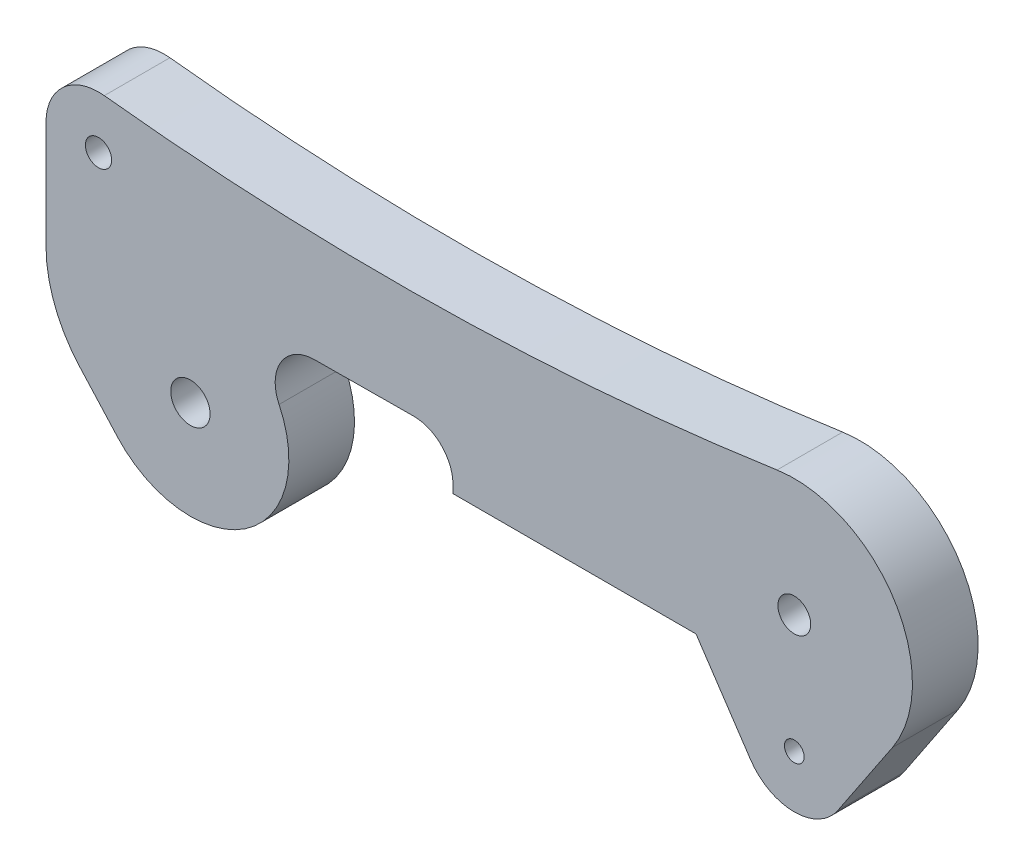
ISO-10303-21;
HEADER;
FILE_DESCRIPTION(('STEP AP214'),'2;1');
FILE_NAME('part.step','',(''),(''),'','','');
FILE_SCHEMA(('AUTOMOTIVE_DESIGN { 1 0 10303 214 1 1 1 1 }'));
ENDSEC;
DATA;
#1=APPLICATION_CONTEXT('core data for automotive mechanical design processes');
#2=APPLICATION_PROTOCOL_DEFINITION('international standard','automotive_design',2000,#1);
#3=PRODUCT_CONTEXT('',#1,'mechanical');
#4=PRODUCT('Part','Part','',(#3));
#5=PRODUCT_RELATED_PRODUCT_CATEGORY('part','',(#4));
#6=PRODUCT_DEFINITION_FORMATION('','',#4);
#7=PRODUCT_DEFINITION_CONTEXT('part definition',#1,'design');
#8=PRODUCT_DEFINITION('design','',#6,#7);
#9=PRODUCT_DEFINITION_SHAPE('','',#8);
#10=(LENGTH_UNIT() NAMED_UNIT(*) SI_UNIT(.MILLI.,.METRE.));
#11=(NAMED_UNIT(*) PLANE_ANGLE_UNIT() SI_UNIT($,.RADIAN.));
#12=(NAMED_UNIT(*) SI_UNIT($,.STERADIAN.) SOLID_ANGLE_UNIT());
#13=UNCERTAINTY_MEASURE_WITH_UNIT(LENGTH_MEASURE(1.E-05),#10,'distance_accuracy_value','');
#14=(GEOMETRIC_REPRESENTATION_CONTEXT(3) GLOBAL_UNCERTAINTY_ASSIGNED_CONTEXT((#13)) GLOBAL_UNIT_ASSIGNED_CONTEXT((#10,
#11,#12)) REPRESENTATION_CONTEXT('',''));
#15=CARTESIAN_POINT('',(0.,0.,0.));
#16=DIRECTION('',(0.,0.,1.));
#17=DIRECTION('',(1.,0.,0.));
#18=AXIS2_PLACEMENT_3D('',#15,#16,#17);
#19=CARTESIAN_POINT('',(9.45617541306992,4.56407126995754,5.));
#20=DIRECTION('',(0.,0.,-1.));
#21=DIRECTION('',(-1.,0.,0.));
#22=AXIS2_PLACEMENT_3D('',#19,#20,#21);
#23=PLANE('',#22);
#24=CARTESIAN_POINT('',(9.45617541306992,4.56407126995754,5.));
#25=DIRECTION('',(0.,0.,-1.));
#26=DIRECTION('',(-1.,0.,0.));
#27=AXIS2_PLACEMENT_3D('',#24,#25,#26);
#28=CIRCLE('',#27,3.);
#29=CARTESIAN_POINT('',(6.75441100933566,3.26005090711253,5.));
#30=VERTEX_POINT('',#29);
#31=CARTESIAN_POINT('',(9.43588173986191,7.56400263031026,5.));
#32=VERTEX_POINT('',#31);
#33=EDGE_CURVE('E209',#30,#32,#28,.T.);
#34=ORIENTED_EDGE('',*,*,#33,.T.);
#35=DIRECTION('',(0.999977120117574,0.00676455773600528,0.));
#36=VECTOR('',#35,1.);
#37=CARTESIAN_POINT('',(16.979706326792,7.61503443488054,5.));
#38=LINE('',#37,#36);
#39=CARTESIAN_POINT('',(16.979706326792,7.61503443488054,5.));
#40=VERTEX_POINT('',#39);
#41=EDGE_CURVE('E122',#32,#40,#38,.T.);
#42=ORIENTED_EDGE('',*,*,#41,.T.);
#43=CARTESIAN_POINT('',(17.,4.61510307452782,5.));
#44=DIRECTION('',(0.,0.,-1.));
#45=DIRECTION('',(1.,0.,0.));
#46=AXIS2_PLACEMENT_3D('',#43,#44,#45);
#47=CIRCLE('',#46,3.);
#48=CARTESIAN_POINT('',(20.,4.61510307452782,5.));
#49=VERTEX_POINT('',#48);
#50=EDGE_CURVE('E245',#40,#49,#47,.T.);
#51=ORIENTED_EDGE('',*,*,#50,.T.);
#52=DIRECTION('',(0.,-1.,0.));
#53=VECTOR('',#52,1.);
#54=CARTESIAN_POINT('',(20.,4.,5.));
#55=LINE('',#54,#53);
#56=CARTESIAN_POINT('',(20.,4.,5.));
#57=VERTEX_POINT('',#56);
#58=EDGE_CURVE('E264',#49,#57,#55,.T.);
#59=ORIENTED_EDGE('',*,*,#58,.T.);
#60=DIRECTION('',(1.,0.,0.));
#61=VECTOR('',#60,1.);
#62=CARTESIAN_POINT('',(38.5166852264521,4.,5.));
#63=LINE('',#62,#61);
#64=CARTESIAN_POINT('',(38.5166852264521,4.,5.));
#65=VERTEX_POINT('',#64);
#66=EDGE_CURVE('E261',#57,#65,#63,.T.);
#67=ORIENTED_EDGE('',*,*,#66,.T.);
#68=DIRECTION('',(0.555555555555556,-0.831479419283098,0.));
#69=VECTOR('',#68,1.);
#70=CARTESIAN_POINT('',(42.6740823228676,-2.22222222222222,5.));
#71=LINE('',#70,#69);
#72=CARTESIAN_POINT('',(42.6740823228676,-2.22222222222222,5.));
#73=VERTEX_POINT('',#72);
#74=EDGE_CURVE('E263',#65,#73,#71,.T.);
#75=ORIENTED_EDGE('',*,*,#74,.T.);
#76=CARTESIAN_POINT('',(46.,0.,5.));
#77=DIRECTION('',(0.,0.,1.));
#78=DIRECTION('',(1.,0.,0.));
#79=AXIS2_PLACEMENT_3D('',#76,#77,#78);
#80=CIRCLE('',#79,4.);
#81=CARTESIAN_POINT('',(49.3259176771324,-2.22222222222219,5.));
#82=VERTEX_POINT('',#81);
#83=EDGE_CURVE('E266',#73,#82,#80,.T.);
#84=ORIENTED_EDGE('',*,*,#83,.T.);
#85=DIRECTION('',(0.555555555555556,0.831479419283098,0.));
#86=VECTOR('',#85,1.);
#87=CARTESIAN_POINT('',(53.4833147735479,4.,5.));
#88=LINE('',#87,#86);
#89=CARTESIAN_POINT('',(53.4833147735478,4.00000000000002,5.));
#90=VERTEX_POINT('',#89);
#91=EDGE_CURVE('E272',#82,#90,#88,.T.);
#92=ORIENTED_EDGE('',*,*,#91,.T.);
#93=CARTESIAN_POINT('',(46.,9.,5.));
#94=DIRECTION('',(0.,0.,1.));
#95=DIRECTION('',(1.,0.,0.));
#96=AXIS2_PLACEMENT_3D('',#93,#94,#95);
#97=CIRCLE('',#96,8.99999999999996);
#98=CARTESIAN_POINT('',(44.6854116319225,17.9034744579021,5.));
#99=VERTEX_POINT('',#98);
#100=EDGE_CURVE('E274',#90,#99,#97,.T.);
#101=ORIENTED_EDGE('',*,*,#100,.T.);
#102=CARTESIAN_POINT('',(15.4723367857572,215.758462411283,5.));
#103=DIRECTION('',(0.,0.,-1.));
#104=DIRECTION('',(1.,0.,0.));
#105=AXIS2_PLACEMENT_3D('',#102,#103,#104);
#106=CIRCLE('',#105,200.);
#107=CARTESIAN_POINT('',(-6.55936594537731,16.9756561257114,5.));
#108=VERTEX_POINT('',#107);
#109=EDGE_CURVE('E276',#99,#108,#106,.T.);
#110=ORIENTED_EDGE('',*,*,#109,.T.);
#111=CARTESIAN_POINT('',(-7.,13.,5.));
#112=DIRECTION('',(0.,0.,1.));
#113=DIRECTION('',(1.,0.,0.));
#114=AXIS2_PLACEMENT_3D('',#111,#112,#113);
#115=CIRCLE('',#114,3.99999999999998);
#116=CARTESIAN_POINT('',(-11.,13.,5.));
#117=VERTEX_POINT('',#116);
#118=EDGE_CURVE('E278',#108,#117,#115,.T.);
#119=ORIENTED_EDGE('',*,*,#118,.T.);
#120=DIRECTION('',(0.,-1.,0.));
#121=VECTOR('',#120,1.);
#122=CARTESIAN_POINT('',(-11.,13.,5.));
#123=LINE('',#122,#121);
#124=CARTESIAN_POINT('',(-11.,4.8425066865478,5.));
#125=VERTEX_POINT('',#124);
#126=EDGE_CURVE('E162',#117,#125,#123,.T.);
#127=ORIENTED_EDGE('',*,*,#126,.T.);
#128=CARTESIAN_POINT('',(-1.,4.8425066865478,5.));
#129=DIRECTION('',(0.,0.,1.));
#130=DIRECTION('',(-1.,0.,0.));
#131=AXIS2_PLACEMENT_3D('',#128,#129,#130);
#132=CIRCLE('',#131,10.);
#133=CARTESIAN_POINT('',(-8.42693748935353,-1.85380569634139,5.));
#134=VERTEX_POINT('',#133);
#135=EDGE_CURVE('E156',#125,#134,#132,.T.);
#136=ORIENTED_EDGE('',*,*,#135,.T.);
#137=DIRECTION('',(0.669631238288916,-0.742693748935356,0.));
#138=VECTOR('',#137,1.);
#139=CARTESIAN_POINT('',(-8.42693748935353,-1.85380569634139,5.));
#140=LINE('',#139,#138);
#141=CARTESIAN_POINT('',(-5.57020311701517,-5.02223428716687,5.));
#142=VERTEX_POINT('',#141);
#143=EDGE_CURVE('E160',#134,#142,#140,.T.);
#144=ORIENTED_EDGE('',*,*,#143,.T.);
#145=CARTESIAN_POINT('',(0.,0.,5.));
#146=DIRECTION('',(0.,0.,1.));
#147=DIRECTION('',(1.,0.,0.));
#148=AXIS2_PLACEMENT_3D('',#145,#146,#147);
#149=CIRCLE('',#148,7.5);
#150=EDGE_CURVE('E58',#142,#30,#149,.T.);
#151=ORIENTED_EDGE('',*,*,#150,.T.);
#152=EDGE_LOOP('',(#34,#42,#51,#59,#67,#75,#84,#92,#101,#110,#119,#127,#136,#144,#151));
#153=FACE_BOUND('',#152,.T.);
#154=CARTESIAN_POINT('',(0.,0.,5.));
#155=DIRECTION('',(0.,0.,1.));
#156=DIRECTION('',(1.,0.,0.));
#157=AXIS2_PLACEMENT_3D('',#154,#155,#156);
#158=CIRCLE('',#157,1.5);
#159=CARTESIAN_POINT('',(1.5,0.,5.));
#160=VERTEX_POINT('',#159);
#161=EDGE_CURVE('E184',#160,#160,#158,.T.);
#162=ORIENTED_EDGE('',*,*,#161,.F.);
#163=EDGE_LOOP('',(#162));
#164=FACE_BOUND('',#163,.T.);
#165=CARTESIAN_POINT('',(46.,0.,5.));
#166=DIRECTION('',(0.,0.,1.));
#167=DIRECTION('',(1.,0.,0.));
#168=AXIS2_PLACEMENT_3D('',#165,#166,#167);
#169=CIRCLE('',#168,0.749999999999999);
#170=CARTESIAN_POINT('',(46.75,0.,5.));
#171=VERTEX_POINT('',#170);
#172=EDGE_CURVE('E342',#171,#171,#169,.T.);
#173=ORIENTED_EDGE('',*,*,#172,.F.);
#174=EDGE_LOOP('',(#173));
#175=FACE_BOUND('',#174,.T.);
#176=CARTESIAN_POINT('',(46.,9.,5.));
#177=DIRECTION('',(0.,0.,1.));
#178=DIRECTION('',(1.,0.,0.));
#179=AXIS2_PLACEMENT_3D('',#176,#177,#178);
#180=CIRCLE('',#179,1.25);
#181=CARTESIAN_POINT('',(47.25,9.,5.));
#182=VERTEX_POINT('',#181);
#183=EDGE_CURVE('E336',#182,#182,#180,.T.);
#184=ORIENTED_EDGE('',*,*,#183,.F.);
#185=EDGE_LOOP('',(#184));
#186=FACE_BOUND('',#185,.T.);
#187=CARTESIAN_POINT('',(-7.,13.,5.));
#188=DIRECTION('',(0.,0.,1.));
#189=DIRECTION('',(1.,0.,0.));
#190=AXIS2_PLACEMENT_3D('',#187,#188,#189);
#191=CIRCLE('',#190,1.);
#192=CARTESIAN_POINT('',(-6.,13.,5.));
#193=VERTEX_POINT('',#192);
#194=EDGE_CURVE('E327',#193,#193,#191,.T.);
#195=ORIENTED_EDGE('',*,*,#194,.F.);
#196=EDGE_LOOP('',(#195));
#197=FACE_BOUND('',#196,.T.);
#198=ADVANCED_FACE('F41',(#153,#164,#175,#186,#197),#23,.F.);
#199=CARTESIAN_POINT('',(9.45617541306992,4.56407126995754,0.));
#200=DIRECTION('',(0.,0.,-1.));
#201=DIRECTION('',(-1.,0.,0.));
#202=AXIS2_PLACEMENT_3D('',#199,#200,#201);
#203=PLANE('',#202);
#204=CARTESIAN_POINT('',(46.,9.,0.));
#205=DIRECTION('',(0.,0.,1.));
#206=DIRECTION('',(1.,0.,0.));
#207=AXIS2_PLACEMENT_3D('',#204,#205,#206);
#208=CIRCLE('',#207,1.25);
#209=CARTESIAN_POINT('',(47.25,9.,0.));
#210=VERTEX_POINT('',#209);
#211=EDGE_CURVE('E333',#210,#210,#208,.T.);
#212=ORIENTED_EDGE('',*,*,#211,.T.);
#213=EDGE_LOOP('',(#212));
#214=FACE_BOUND('',#213,.T.);
#215=CARTESIAN_POINT('',(0.,0.,0.));
#216=DIRECTION('',(0.,0.,1.));
#217=DIRECTION('',(1.,0.,0.));
#218=AXIS2_PLACEMENT_3D('',#215,#216,#217);
#219=CIRCLE('',#218,1.5);
#220=CARTESIAN_POINT('',(1.5,0.,0.));
#221=VERTEX_POINT('',#220);
#222=EDGE_CURVE('E345',#221,#221,#219,.T.);
#223=ORIENTED_EDGE('',*,*,#222,.T.);
#224=EDGE_LOOP('',(#223));
#225=FACE_BOUND('',#224,.T.);
#226=CARTESIAN_POINT('',(9.45617541306992,4.56407126995754,0.));
#227=DIRECTION('',(0.,0.,-1.));
#228=DIRECTION('',(-1.,0.,0.));
#229=AXIS2_PLACEMENT_3D('',#226,#227,#228);
#230=CIRCLE('',#229,3.);
#231=CARTESIAN_POINT('',(6.75441100933566,3.26005090711253,0.));
#232=VERTEX_POINT('',#231);
#233=CARTESIAN_POINT('',(9.43588173986191,7.56400263031026,0.));
#234=VERTEX_POINT('',#233);
#235=EDGE_CURVE('E180',#232,#234,#230,.T.);
#236=ORIENTED_EDGE('',*,*,#235,.F.);
#237=CARTESIAN_POINT('',(0.,0.,0.));
#238=DIRECTION('',(0.,0.,1.));
#239=DIRECTION('',(1.,0.,0.));
#240=AXIS2_PLACEMENT_3D('',#237,#238,#239);
#241=CIRCLE('',#240,7.5);
#242=CARTESIAN_POINT('',(-5.57020311701517,-5.02223428716687,0.));
#243=VERTEX_POINT('',#242);
#244=EDGE_CURVE('E114',#243,#232,#241,.T.);
#245=ORIENTED_EDGE('',*,*,#244,.F.);
#246=DIRECTION('',(0.669631238288916,-0.742693748935356,0.));
#247=VECTOR('',#246,1.);
#248=CARTESIAN_POINT('',(-8.42693748935353,-1.85380569634139,0.));
#249=LINE('',#248,#247);
#250=CARTESIAN_POINT('',(-8.42693748935353,-1.85380569634139,0.));
#251=VERTEX_POINT('',#250);
#252=EDGE_CURVE('E108',#251,#243,#249,.T.);
#253=ORIENTED_EDGE('',*,*,#252,.F.);
#254=CARTESIAN_POINT('',(-1.,4.8425066865478,0.));
#255=DIRECTION('',(0.,0.,1.));
#256=DIRECTION('',(-1.,0.,0.));
#257=AXIS2_PLACEMENT_3D('',#254,#255,#256);
#258=CIRCLE('',#257,10.);
#259=CARTESIAN_POINT('',(-11.,4.8425066865478,0.));
#260=VERTEX_POINT('',#259);
#261=EDGE_CURVE('E170',#260,#251,#258,.T.);
#262=ORIENTED_EDGE('',*,*,#261,.F.);
#263=DIRECTION('',(0.,-1.,0.));
#264=VECTOR('',#263,1.);
#265=CARTESIAN_POINT('',(-11.,13.,0.));
#266=LINE('',#265,#264);
#267=CARTESIAN_POINT('',(-11.,13.,0.));
#268=VERTEX_POINT('',#267);
#269=EDGE_CURVE('E204',#268,#260,#266,.T.);
#270=ORIENTED_EDGE('',*,*,#269,.F.);
#271=CARTESIAN_POINT('',(-7.,13.,0.));
#272=DIRECTION('',(0.,0.,1.));
#273=DIRECTION('',(1.,0.,0.));
#274=AXIS2_PLACEMENT_3D('',#271,#272,#273);
#275=CIRCLE('',#274,3.99999999999998);
#276=CARTESIAN_POINT('',(-6.55936594537731,16.9756561257114,0.));
#277=VERTEX_POINT('',#276);
#278=EDGE_CURVE('E202',#277,#268,#275,.T.);
#279=ORIENTED_EDGE('',*,*,#278,.F.);
#280=CARTESIAN_POINT('',(15.4723367857572,215.758462411283,0.));
#281=DIRECTION('',(0.,0.,-1.));
#282=DIRECTION('',(1.,0.,0.));
#283=AXIS2_PLACEMENT_3D('',#280,#281,#282);
#284=CIRCLE('',#283,200.);
#285=CARTESIAN_POINT('',(44.6854116319225,17.9034744579021,0.));
#286=VERTEX_POINT('',#285);
#287=EDGE_CURVE('E200',#286,#277,#284,.T.);
#288=ORIENTED_EDGE('',*,*,#287,.F.);
#289=CARTESIAN_POINT('',(46.,9.,0.));
#290=DIRECTION('',(0.,0.,1.));
#291=DIRECTION('',(1.,0.,0.));
#292=AXIS2_PLACEMENT_3D('',#289,#290,#291);
#293=CIRCLE('',#292,8.99999999999996);
#294=CARTESIAN_POINT('',(53.4833147735478,4.00000000000002,0.));
#295=VERTEX_POINT('',#294);
#296=EDGE_CURVE('E198',#295,#286,#293,.T.);
#297=ORIENTED_EDGE('',*,*,#296,.F.);
#298=DIRECTION('',(0.555555555555556,0.831479419283098,0.));
#299=VECTOR('',#298,1.);
#300=CARTESIAN_POINT('',(53.4833147735479,4.,0.));
#301=LINE('',#300,#299);
#302=CARTESIAN_POINT('',(49.3259176771324,-2.22222222222219,0.));
#303=VERTEX_POINT('',#302);
#304=EDGE_CURVE('E196',#303,#295,#301,.T.);
#305=ORIENTED_EDGE('',*,*,#304,.F.);
#306=CARTESIAN_POINT('',(46.,0.,0.));
#307=DIRECTION('',(0.,0.,1.));
#308=DIRECTION('',(1.,0.,0.));
#309=AXIS2_PLACEMENT_3D('',#306,#307,#308);
#310=CIRCLE('',#309,4.);
#311=CARTESIAN_POINT('',(42.6740823228676,-2.22222222222222,0.));
#312=VERTEX_POINT('',#311);
#313=EDGE_CURVE('E194',#312,#303,#310,.T.);
#314=ORIENTED_EDGE('',*,*,#313,.F.);
#315=DIRECTION('',(0.555555555555556,-0.831479419283098,0.));
#316=VECTOR('',#315,1.);
#317=CARTESIAN_POINT('',(42.6740823228676,-2.22222222222222,0.));
#318=LINE('',#317,#316);
#319=CARTESIAN_POINT('',(38.5166852264521,4.,0.));
#320=VERTEX_POINT('',#319);
#321=EDGE_CURVE('E192',#320,#312,#318,.T.);
#322=ORIENTED_EDGE('',*,*,#321,.F.);
#323=DIRECTION('',(1.,0.,0.));
#324=VECTOR('',#323,1.);
#325=CARTESIAN_POINT('',(38.5166852264521,4.,0.));
#326=LINE('',#325,#324);
#327=CARTESIAN_POINT('',(20.,4.,0.));
#328=VERTEX_POINT('',#327);
#329=EDGE_CURVE('E190',#328,#320,#326,.T.);
#330=ORIENTED_EDGE('',*,*,#329,.F.);
#331=DIRECTION('',(0.,-1.,0.));
#332=VECTOR('',#331,1.);
#333=CARTESIAN_POINT('',(20.,4.,0.));
#334=LINE('',#333,#332);
#335=CARTESIAN_POINT('',(20.,4.61510307452782,0.));
#336=VERTEX_POINT('',#335);
#337=EDGE_CURVE('E188',#336,#328,#334,.T.);
#338=ORIENTED_EDGE('',*,*,#337,.F.);
#339=CARTESIAN_POINT('',(17.,4.61510307452782,0.));
#340=DIRECTION('',(0.,0.,-1.));
#341=DIRECTION('',(1.,0.,0.));
#342=AXIS2_PLACEMENT_3D('',#339,#340,#341);
#343=CIRCLE('',#342,3.);
#344=CARTESIAN_POINT('',(16.979706326792,7.61503443488054,0.));
#345=VERTEX_POINT('',#344);
#346=EDGE_CURVE('E186',#345,#336,#343,.T.);
#347=ORIENTED_EDGE('',*,*,#346,.F.);
#348=DIRECTION('',(0.999977120117574,0.00676455773600528,0.));
#349=VECTOR('',#348,1.);
#350=CARTESIAN_POINT('',(16.979706326792,7.61503443488054,0.));
#351=LINE('',#350,#349);
#352=EDGE_CURVE('E183',#234,#345,#351,.T.);
#353=ORIENTED_EDGE('',*,*,#352,.F.);
#354=EDGE_LOOP('',(#236,#245,#253,#262,#270,#279,#288,#297,#305,#314,#322,#330,#338,#347,#353));
#355=FACE_BOUND('',#354,.T.);
#356=CARTESIAN_POINT('',(46.,0.,0.));
#357=DIRECTION('',(0.,0.,1.));
#358=DIRECTION('',(1.,0.,0.));
#359=AXIS2_PLACEMENT_3D('',#356,#357,#358);
#360=CIRCLE('',#359,0.749999999999999);
#361=CARTESIAN_POINT('',(46.75,0.,0.));
#362=VERTEX_POINT('',#361);
#363=EDGE_CURVE('E339',#362,#362,#360,.T.);
#364=ORIENTED_EDGE('',*,*,#363,.T.);
#365=EDGE_LOOP('',(#364));
#366=FACE_BOUND('',#365,.T.);
#367=CARTESIAN_POINT('',(-7.,13.,0.));
#368=DIRECTION('',(0.,0.,1.));
#369=DIRECTION('',(1.,0.,0.));
#370=AXIS2_PLACEMENT_3D('',#367,#368,#369);
#371=CIRCLE('',#370,1.);
#372=CARTESIAN_POINT('',(-6.,13.,0.));
#373=VERTEX_POINT('',#372);
#374=EDGE_CURVE('E330',#373,#373,#371,.T.);
#375=ORIENTED_EDGE('',*,*,#374,.T.);
#376=EDGE_LOOP('',(#375));
#377=FACE_BOUND('',#376,.T.);
#378=ADVANCED_FACE('F249',(#214,#225,#355,#366,#377),#203,.T.);
#379=CARTESIAN_POINT('',(9.45617541306992,4.56407126995754,5.));
#380=DIRECTION('',(0.,0.,-1.));
#381=DIRECTION('',(-1.,0.,0.));
#382=AXIS2_PLACEMENT_3D('',#379,#380,#381);
#383=CYLINDRICAL_SURFACE('',#382,3.);
#384=ORIENTED_EDGE('',*,*,#235,.T.);
#385=DIRECTION('',(0.,0.,-1.));
#386=VECTOR('',#385,1.);
#387=CARTESIAN_POINT('',(9.43588173986191,7.56400263031026,5.));
#388=LINE('',#387,#386);
#389=EDGE_CURVE('E11',#32,#234,#388,.T.);
#390=ORIENTED_EDGE('',*,*,#389,.F.);
#391=ORIENTED_EDGE('',*,*,#33,.F.);
#392=DIRECTION('',(0.,0.,-1.));
#393=VECTOR('',#392,1.);
#394=CARTESIAN_POINT('',(6.75441100933566,3.26005090711253,5.));
#395=LINE('',#394,#393);
#396=EDGE_CURVE('E176',#30,#232,#395,.T.);
#397=ORIENTED_EDGE('',*,*,#396,.T.);
#398=EDGE_LOOP('',(#384,#390,#391,#397));
#399=FACE_BOUND('',#398,.T.);
#400=ADVANCED_FACE('F43',(#399),#383,.F.);
#401=CARTESIAN_POINT('',(16.979706326792,7.61503443488054,5.));
#402=DIRECTION('',(-0.00676455773600528,0.999977120117574,0.));
#403=DIRECTION('',(-0.999977120117574,-0.00676455773600528,0.));
#404=AXIS2_PLACEMENT_3D('',#401,#402,#403);
#405=PLANE('',#404);
#406=ORIENTED_EDGE('',*,*,#352,.T.);
#407=DIRECTION('',(0.,0.,-1.));
#408=VECTOR('',#407,1.);
#409=CARTESIAN_POINT('',(16.979706326792,7.61503443488054,5.));
#410=LINE('',#409,#408);
#411=EDGE_CURVE('E50',#40,#345,#410,.T.);
#412=ORIENTED_EDGE('',*,*,#411,.F.);
#413=ORIENTED_EDGE('',*,*,#41,.F.);
#414=ORIENTED_EDGE('',*,*,#389,.T.);
#415=EDGE_LOOP('',(#406,#412,#413,#414));
#416=FACE_BOUND('',#415,.T.);
#417=ADVANCED_FACE('F433',(#416),#405,.F.);
#418=CARTESIAN_POINT('',(17.,4.61510307452782,5.));
#419=DIRECTION('',(0.,0.,-1.));
#420=DIRECTION('',(-1.,0.,0.));
#421=AXIS2_PLACEMENT_3D('',#418,#419,#420);
#422=CYLINDRICAL_SURFACE('',#421,3.);
#423=ORIENTED_EDGE('',*,*,#346,.T.);
#424=DIRECTION('',(0.,0.,-1.));
#425=VECTOR('',#424,1.);
#426=CARTESIAN_POINT('',(20.,4.61510307452782,5.));
#427=LINE('',#426,#425);
#428=EDGE_CURVE('E237',#49,#336,#427,.T.);
#429=ORIENTED_EDGE('',*,*,#428,.F.);
#430=ORIENTED_EDGE('',*,*,#50,.F.);
#431=ORIENTED_EDGE('',*,*,#411,.T.);
#432=EDGE_LOOP('',(#423,#429,#430,#431));
#433=FACE_BOUND('',#432,.T.);
#434=ADVANCED_FACE('F243',(#433),#422,.F.);
#435=CARTESIAN_POINT('',(20.,4.,5.));
#436=DIRECTION('',(1.,0.,0.));
#437=DIRECTION('',(0.,0.,-1.));
#438=AXIS2_PLACEMENT_3D('',#435,#436,#437);
#439=PLANE('',#438);
#440=ORIENTED_EDGE('',*,*,#337,.T.);
#441=DIRECTION('',(0.,0.,-1.));
#442=VECTOR('',#441,1.);
#443=CARTESIAN_POINT('',(20.,4.,5.));
#444=LINE('',#443,#442);
#445=EDGE_CURVE('E234',#57,#328,#444,.T.);
#446=ORIENTED_EDGE('',*,*,#445,.F.);
#447=ORIENTED_EDGE('',*,*,#58,.F.);
#448=ORIENTED_EDGE('',*,*,#428,.T.);
#449=EDGE_LOOP('',(#440,#446,#447,#448));
#450=FACE_BOUND('',#449,.T.);
#451=ADVANCED_FACE('F255',(#450),#439,.F.);
#452=CARTESIAN_POINT('',(38.5166852264521,4.,5.));
#453=DIRECTION('',(0.,1.,0.));
#454=DIRECTION('',(-1.,0.,0.));
#455=AXIS2_PLACEMENT_3D('',#452,#453,#454);
#456=PLANE('',#455);
#457=ORIENTED_EDGE('',*,*,#329,.T.);
#458=DIRECTION('',(0.,0.,-1.));
#459=VECTOR('',#458,1.);
#460=CARTESIAN_POINT('',(38.5166852264521,4.,5.));
#461=LINE('',#460,#459);
#462=EDGE_CURVE('E231',#65,#320,#461,.T.);
#463=ORIENTED_EDGE('',*,*,#462,.F.);
#464=ORIENTED_EDGE('',*,*,#66,.F.);
#465=ORIENTED_EDGE('',*,*,#445,.T.);
#466=EDGE_LOOP('',(#457,#463,#464,#465));
#467=FACE_BOUND('',#466,.T.);
#468=ADVANCED_FACE('F259',(#467),#456,.F.);
#469=CARTESIAN_POINT('',(42.6740823228676,-2.22222222222222,5.));
#470=DIRECTION('',(0.831479419283098,0.555555555555556,0.));
#471=DIRECTION('',(-0.555555555555556,0.831479419283098,0.));
#472=AXIS2_PLACEMENT_3D('',#469,#470,#471);
#473=PLANE('',#472);
#474=ORIENTED_EDGE('',*,*,#321,.T.);
#475=DIRECTION('',(0.,0.,-1.));
#476=VECTOR('',#475,1.);
#477=CARTESIAN_POINT('',(42.6740823228676,-2.22222222222222,5.));
#478=LINE('',#477,#476);
#479=EDGE_CURVE('E228',#73,#312,#478,.T.);
#480=ORIENTED_EDGE('',*,*,#479,.F.);
#481=ORIENTED_EDGE('',*,*,#74,.F.);
#482=ORIENTED_EDGE('',*,*,#462,.T.);
#483=EDGE_LOOP('',(#474,#480,#481,#482));
#484=FACE_BOUND('',#483,.T.);
#485=ADVANCED_FACE('F464',(#484),#473,.F.);
#486=CARTESIAN_POINT('',(46.,0.,5.));
#487=DIRECTION('',(0.,0.,-1.));
#488=DIRECTION('',(-1.,0.,0.));
#489=AXIS2_PLACEMENT_3D('',#486,#487,#488);
#490=CYLINDRICAL_SURFACE('',#489,4.);
#491=ORIENTED_EDGE('',*,*,#313,.T.);
#492=DIRECTION('',(0.,0.,-1.));
#493=VECTOR('',#492,1.);
#494=CARTESIAN_POINT('',(49.3259176771324,-2.22222222222219,5.));
#495=LINE('',#494,#493);
#496=EDGE_CURVE('E225',#82,#303,#495,.T.);
#497=ORIENTED_EDGE('',*,*,#496,.F.);
#498=ORIENTED_EDGE('',*,*,#83,.F.);
#499=ORIENTED_EDGE('',*,*,#479,.T.);
#500=EDGE_LOOP('',(#491,#497,#498,#499));
#501=FACE_BOUND('',#500,.T.);
#502=ADVANCED_FACE('F473',(#501),#490,.T.);
#503=CARTESIAN_POINT('',(53.4833147735479,4.,5.));
#504=DIRECTION('',(-0.831479419283098,0.555555555555556,0.));
#505=DIRECTION('',(-0.555555555555556,-0.831479419283098,0.));
#506=AXIS2_PLACEMENT_3D('',#503,#504,#505);
#507=PLANE('',#506);
#508=ORIENTED_EDGE('',*,*,#304,.T.);
#509=DIRECTION('',(0.,0.,-1.));
#510=VECTOR('',#509,1.);
#511=CARTESIAN_POINT('',(53.4833147735478,4.00000000000002,5.));
#512=LINE('',#511,#510);
#513=EDGE_CURVE('E222',#90,#295,#512,.T.);
#514=ORIENTED_EDGE('',*,*,#513,.F.);
#515=ORIENTED_EDGE('',*,*,#91,.F.);
#516=ORIENTED_EDGE('',*,*,#496,.T.);
#517=EDGE_LOOP('',(#508,#514,#515,#516));
#518=FACE_BOUND('',#517,.T.);
#519=ADVANCED_FACE('F483',(#518),#507,.F.);
#520=CARTESIAN_POINT('',(46.,9.,5.));
#521=DIRECTION('',(0.,0.,-1.));
#522=DIRECTION('',(-1.,0.,0.));
#523=AXIS2_PLACEMENT_3D('',#520,#521,#522);
#524=CYLINDRICAL_SURFACE('',#523,8.99999999999996);
#525=ORIENTED_EDGE('',*,*,#296,.T.);
#526=DIRECTION('',(0.,0.,-1.));
#527=VECTOR('',#526,1.);
#528=CARTESIAN_POINT('',(44.6854116319225,17.9034744579021,5.));
#529=LINE('',#528,#527);
#530=EDGE_CURVE('E219',#99,#286,#529,.T.);
#531=ORIENTED_EDGE('',*,*,#530,.F.);
#532=ORIENTED_EDGE('',*,*,#100,.F.);
#533=ORIENTED_EDGE('',*,*,#513,.T.);
#534=EDGE_LOOP('',(#525,#531,#532,#533));
#535=FACE_BOUND('',#534,.T.);
#536=ADVANCED_FACE('F493',(#535),#524,.T.);
#537=CARTESIAN_POINT('',(15.4723367857572,215.758462411283,5.));
#538=DIRECTION('',(0.,0.,-1.));
#539=DIRECTION('',(-1.,0.,0.));
#540=AXIS2_PLACEMENT_3D('',#537,#538,#539);
#541=CYLINDRICAL_SURFACE('',#540,200.);
#542=ORIENTED_EDGE('',*,*,#287,.T.);
#543=DIRECTION('',(0.,0.,-1.));
#544=VECTOR('',#543,1.);
#545=CARTESIAN_POINT('',(-6.55936594537731,16.9756561257114,5.));
#546=LINE('',#545,#544);
#547=EDGE_CURVE('E216',#108,#277,#546,.T.);
#548=ORIENTED_EDGE('',*,*,#547,.F.);
#549=ORIENTED_EDGE('',*,*,#109,.F.);
#550=ORIENTED_EDGE('',*,*,#530,.T.);
#551=EDGE_LOOP('',(#542,#548,#549,#550));
#552=FACE_BOUND('',#551,.T.);
#553=ADVANCED_FACE('F503',(#552),#541,.F.);
#554=CARTESIAN_POINT('',(-7.,13.,5.));
#555=DIRECTION('',(0.,0.,-1.));
#556=DIRECTION('',(-1.,0.,0.));
#557=AXIS2_PLACEMENT_3D('',#554,#555,#556);
#558=CYLINDRICAL_SURFACE('',#557,3.99999999999998);
#559=ORIENTED_EDGE('',*,*,#278,.T.);
#560=DIRECTION('',(0.,0.,-1.));
#561=VECTOR('',#560,1.);
#562=CARTESIAN_POINT('',(-11.,13.,5.));
#563=LINE('',#562,#561);
#564=EDGE_CURVE('E213',#117,#268,#563,.T.);
#565=ORIENTED_EDGE('',*,*,#564,.F.);
#566=ORIENTED_EDGE('',*,*,#118,.F.);
#567=ORIENTED_EDGE('',*,*,#547,.T.);
#568=EDGE_LOOP('',(#559,#565,#566,#567));
#569=FACE_BOUND('',#568,.T.);
#570=ADVANCED_FACE('F284',(#569),#558,.T.);
#571=CARTESIAN_POINT('',(-11.,13.,5.));
#572=DIRECTION('',(1.,0.,0.));
#573=DIRECTION('',(0.,1.,0.));
#574=AXIS2_PLACEMENT_3D('',#571,#572,#573);
#575=PLANE('',#574);
#576=ORIENTED_EDGE('',*,*,#269,.T.);
#577=DIRECTION('',(0.,0.,-1.));
#578=VECTOR('',#577,1.);
#579=CARTESIAN_POINT('',(-11.,4.8425066865478,5.));
#580=LINE('',#579,#578);
#581=EDGE_CURVE('E171',#125,#260,#580,.T.);
#582=ORIENTED_EDGE('',*,*,#581,.F.);
#583=ORIENTED_EDGE('',*,*,#126,.F.);
#584=ORIENTED_EDGE('',*,*,#564,.T.);
#585=EDGE_LOOP('',(#576,#582,#583,#584));
#586=FACE_BOUND('',#585,.T.);
#587=ADVANCED_FACE('F288',(#586),#575,.F.);
#588=CARTESIAN_POINT('',(-1.,4.8425066865478,5.));
#589=DIRECTION('',(0.,0.,-1.));
#590=DIRECTION('',(-1.,0.,0.));
#591=AXIS2_PLACEMENT_3D('',#588,#589,#590);
#592=CYLINDRICAL_SURFACE('',#591,10.);
#593=ORIENTED_EDGE('',*,*,#261,.T.);
#594=DIRECTION('',(0.,0.,-1.));
#595=VECTOR('',#594,1.);
#596=CARTESIAN_POINT('',(-8.42693748935353,-1.85380569634139,5.));
#597=LINE('',#596,#595);
#598=EDGE_CURVE('E167',#134,#251,#597,.T.);
#599=ORIENTED_EDGE('',*,*,#598,.F.);
#600=ORIENTED_EDGE('',*,*,#135,.F.);
#601=ORIENTED_EDGE('',*,*,#581,.T.);
#602=EDGE_LOOP('',(#593,#599,#600,#601));
#603=FACE_BOUND('',#602,.T.);
#604=ADVANCED_FACE('F168',(#603),#592,.T.);
#605=CARTESIAN_POINT('',(-8.42693748935353,-1.85380569634139,5.));
#606=DIRECTION('',(0.742693748935356,0.669631238288916,0.));
#607=DIRECTION('',(-0.669631238288916,0.742693748935356,0.));
#608=AXIS2_PLACEMENT_3D('',#605,#606,#607);
#609=PLANE('',#608);
#610=ORIENTED_EDGE('',*,*,#252,.T.);
#611=DIRECTION('',(0.,0.,-1.));
#612=VECTOR('',#611,1.);
#613=CARTESIAN_POINT('',(-5.57020311701517,-5.02223428716687,5.));
#614=LINE('',#613,#612);
#615=EDGE_CURVE('E172',#142,#243,#614,.T.);
#616=ORIENTED_EDGE('',*,*,#615,.F.);
#617=ORIENTED_EDGE('',*,*,#143,.F.);
#618=ORIENTED_EDGE('',*,*,#598,.T.);
#619=EDGE_LOOP('',(#610,#616,#617,#618));
#620=FACE_BOUND('',#619,.T.);
#621=ADVANCED_FACE('F174',(#620),#609,.F.);
#622=CARTESIAN_POINT('',(0.,0.,5.));
#623=DIRECTION('',(0.,0.,-1.));
#624=DIRECTION('',(-1.,0.,0.));
#625=AXIS2_PLACEMENT_3D('',#622,#623,#624);
#626=CYLINDRICAL_SURFACE('',#625,7.5);
#627=ORIENTED_EDGE('',*,*,#244,.T.);
#628=ORIENTED_EDGE('',*,*,#396,.F.);
#629=ORIENTED_EDGE('',*,*,#150,.F.);
#630=ORIENTED_EDGE('',*,*,#615,.T.);
#631=EDGE_LOOP('',(#627,#628,#629,#630));
#632=FACE_BOUND('',#631,.T.);
#633=ADVANCED_FACE('F292',(#632),#626,.T.);
#634=CARTESIAN_POINT('',(0.,0.,5.));
#635=DIRECTION('',(0.,0.,-1.));
#636=DIRECTION('',(-1.,0.,0.));
#637=AXIS2_PLACEMENT_3D('',#634,#635,#636);
#638=CYLINDRICAL_SURFACE('',#637,1.5);
#639=ORIENTED_EDGE('',*,*,#161,.T.);
#640=EDGE_LOOP('',(#639));
#641=FACE_BOUND('',#640,.T.);
#642=ORIENTED_EDGE('',*,*,#222,.F.);
#643=EDGE_LOOP('',(#642));
#644=FACE_BOUND('',#643,.T.);
#645=ADVANCED_FACE('F294',(#641,#644),#638,.F.);
#646=CARTESIAN_POINT('',(46.,0.,5.));
#647=DIRECTION('',(0.,0.,-1.));
#648=DIRECTION('',(-1.,0.,0.));
#649=AXIS2_PLACEMENT_3D('',#646,#647,#648);
#650=CYLINDRICAL_SURFACE('',#649,0.749999999999999);
#651=ORIENTED_EDGE('',*,*,#172,.T.);
#652=EDGE_LOOP('',(#651));
#653=FACE_BOUND('',#652,.T.);
#654=ORIENTED_EDGE('',*,*,#363,.F.);
#655=EDGE_LOOP('',(#654));
#656=FACE_BOUND('',#655,.T.);
#657=ADVANCED_FACE('F300',(#653,#656),#650,.F.);
#658=CARTESIAN_POINT('',(46.,9.,5.));
#659=DIRECTION('',(0.,0.,-1.));
#660=DIRECTION('',(-1.,0.,0.));
#661=AXIS2_PLACEMENT_3D('',#658,#659,#660);
#662=CYLINDRICAL_SURFACE('',#661,1.25);
#663=ORIENTED_EDGE('',*,*,#183,.T.);
#664=EDGE_LOOP('',(#663));
#665=FACE_BOUND('',#664,.T.);
#666=ORIENTED_EDGE('',*,*,#211,.F.);
#667=EDGE_LOOP('',(#666));
#668=FACE_BOUND('',#667,.T.);
#669=ADVANCED_FACE('F314',(#665,#668),#662,.F.);
#670=CARTESIAN_POINT('',(-7.,13.,5.));
#671=DIRECTION('',(0.,0.,-1.));
#672=DIRECTION('',(-1.,0.,0.));
#673=AXIS2_PLACEMENT_3D('',#670,#671,#672);
#674=CYLINDRICAL_SURFACE('',#673,1.);
#675=ORIENTED_EDGE('',*,*,#194,.T.);
#676=EDGE_LOOP('',(#675));
#677=FACE_BOUND('',#676,.T.);
#678=ORIENTED_EDGE('',*,*,#374,.F.);
#679=EDGE_LOOP('',(#678));
#680=FACE_BOUND('',#679,.T.);
#681=ADVANCED_FACE('F318',(#677,#680),#674,.F.);
#682=CLOSED_SHELL('',(#198,#378,#400,#417,#434,#451,#468,#485,#502,#519,#536,#553,#570,#587,
#604,#621,#633,#645,#657,#669,#681));
#683=MANIFOLD_SOLID_BREP('B2',#682);
#684=ADVANCED_BREP_SHAPE_REPRESENTATION('',(#18,#683),#14);
#685=SHAPE_DEFINITION_REPRESENTATION(#9,#684);
ENDSEC;
END-ISO-10303-21;
